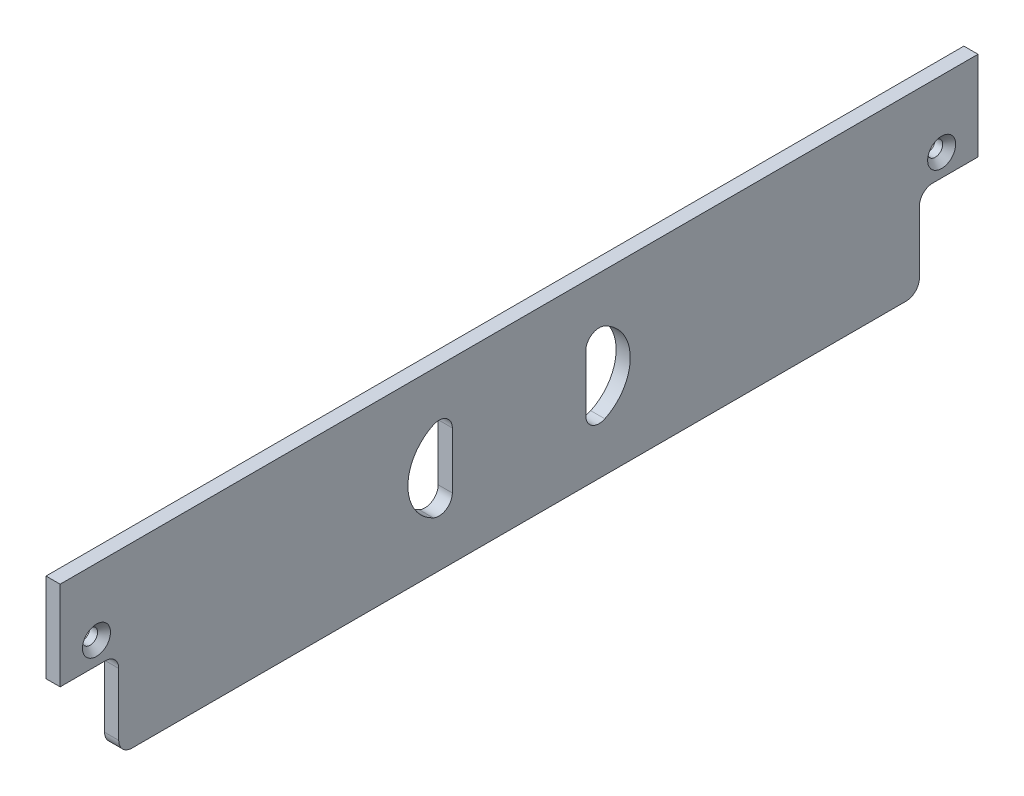
ISO-10303-21;
HEADER;
FILE_DESCRIPTION(('STEP AP214'),'2;1');
FILE_NAME('part.step','',(''),(''),'','','');
FILE_SCHEMA(('AUTOMOTIVE_DESIGN { 1 0 10303 214 1 1 1 1 }'));
ENDSEC;
DATA;
#1=APPLICATION_CONTEXT('core data for automotive mechanical design processes');
#2=APPLICATION_PROTOCOL_DEFINITION('international standard','automotive_design',2000,#1);
#3=PRODUCT_CONTEXT('',#1,'mechanical');
#4=PRODUCT('Part','Part','',(#3));
#5=PRODUCT_RELATED_PRODUCT_CATEGORY('part','',(#4));
#6=PRODUCT_DEFINITION_FORMATION('','',#4);
#7=PRODUCT_DEFINITION_CONTEXT('part definition',#1,'design');
#8=PRODUCT_DEFINITION('design','',#6,#7);
#9=PRODUCT_DEFINITION_SHAPE('','',#8);
#10=(LENGTH_UNIT() NAMED_UNIT(*) SI_UNIT(.MILLI.,.METRE.));
#11=(NAMED_UNIT(*) PLANE_ANGLE_UNIT() SI_UNIT($,.RADIAN.));
#12=(NAMED_UNIT(*) SI_UNIT($,.STERADIAN.) SOLID_ANGLE_UNIT());
#13=UNCERTAINTY_MEASURE_WITH_UNIT(LENGTH_MEASURE(1.E-05),#10,'distance_accuracy_value','');
#14=(GEOMETRIC_REPRESENTATION_CONTEXT(3) GLOBAL_UNCERTAINTY_ASSIGNED_CONTEXT((#13)) GLOBAL_UNIT_ASSIGNED_CONTEXT((#10,
#11,#12)) REPRESENTATION_CONTEXT('',''));
#15=CARTESIAN_POINT('',(0.,0.,0.));
#16=DIRECTION('',(0.,0.,1.));
#17=DIRECTION('',(1.,0.,0.));
#18=AXIS2_PLACEMENT_3D('',#15,#16,#17);
#19=CARTESIAN_POINT('',(3.175,17.,93.));
#20=DIRECTION('',(-1.,0.,0.));
#21=DIRECTION('',(0.,0.,1.));
#22=AXIS2_PLACEMENT_3D('',#19,#20,#21);
#23=PLANE('',#22);
#24=CARTESIAN_POINT('',(3.175,17.,93.));
#25=DIRECTION('',(-1.,0.,0.));
#26=DIRECTION('',(0.,0.,1.));
#27=AXIS2_PLACEMENT_3D('',#24,#25,#26);
#28=CIRCLE('',#27,3.);
#29=CARTESIAN_POINT('',(3.175,20.,93.));
#30=VERTEX_POINT('',#29);
#31=CARTESIAN_POINT('',(3.175,17.,90.));
#32=VERTEX_POINT('',#31);
#33=EDGE_CURVE('E186',#30,#32,#28,.T.);
#34=ORIENTED_EDGE('',*,*,#33,.T.);
#35=DIRECTION('',(0.,-1.,0.));
#36=VECTOR('',#35,1.);
#37=CARTESIAN_POINT('',(3.175,3.,90.));
#38=LINE('',#37,#36);
#39=CARTESIAN_POINT('',(3.175,3.,90.));
#40=VERTEX_POINT('',#39);
#41=EDGE_CURVE('E175',#32,#40,#38,.T.);
#42=ORIENTED_EDGE('',*,*,#41,.T.);
#43=CARTESIAN_POINT('',(3.175,3.,87.));
#44=DIRECTION('',(1.,0.,0.));
#45=DIRECTION('',(0.,0.,1.));
#46=AXIS2_PLACEMENT_3D('',#43,#44,#45);
#47=CIRCLE('',#46,3.);
#48=CARTESIAN_POINT('',(3.175,0.,87.));
#49=VERTEX_POINT('',#48);
#50=EDGE_CURVE('E185',#40,#49,#47,.T.);
#51=ORIENTED_EDGE('',*,*,#50,.T.);
#52=DIRECTION('',(0.,0.,-1.));
#53=VECTOR('',#52,1.);
#54=CARTESIAN_POINT('',(3.175,0.,87.));
#55=LINE('',#54,#53);
#56=CARTESIAN_POINT('',(3.175,0.,-87.));
#57=VERTEX_POINT('',#56);
#58=EDGE_CURVE('E293',#49,#57,#55,.T.);
#59=ORIENTED_EDGE('',*,*,#58,.T.);
#60=CARTESIAN_POINT('',(3.175,3.,-87.));
#61=DIRECTION('',(1.,0.,0.));
#62=DIRECTION('',(0.,0.,-1.));
#63=AXIS2_PLACEMENT_3D('',#60,#61,#62);
#64=CIRCLE('',#63,3.);
#65=CARTESIAN_POINT('',(3.175,3.,-90.));
#66=VERTEX_POINT('',#65);
#67=EDGE_CURVE('E296',#57,#66,#64,.T.);
#68=ORIENTED_EDGE('',*,*,#67,.T.);
#69=DIRECTION('',(0.,1.,0.));
#70=VECTOR('',#69,1.);
#71=CARTESIAN_POINT('',(3.175,3.,-90.));
#72=LINE('',#71,#70);
#73=CARTESIAN_POINT('',(3.175,17.,-90.));
#74=VERTEX_POINT('',#73);
#75=EDGE_CURVE('E298',#66,#74,#72,.T.);
#76=ORIENTED_EDGE('',*,*,#75,.T.);
#77=CARTESIAN_POINT('',(3.175,17.,-93.));
#78=DIRECTION('',(-1.,0.,0.));
#79=DIRECTION('',(0.,0.,-1.));
#80=AXIS2_PLACEMENT_3D('',#77,#78,#79);
#81=CIRCLE('',#80,3.);
#82=CARTESIAN_POINT('',(3.175,20.,-93.));
#83=VERTEX_POINT('',#82);
#84=EDGE_CURVE('E300',#74,#83,#81,.T.);
#85=ORIENTED_EDGE('',*,*,#84,.T.);
#86=DIRECTION('',(0.,0.,-1.));
#87=VECTOR('',#86,1.);
#88=CARTESIAN_POINT('',(3.175,20.,-103.175));
#89=LINE('',#88,#87);
#90=CARTESIAN_POINT('',(3.175,20.,-103.175));
#91=VERTEX_POINT('',#90);
#92=EDGE_CURVE('E302',#83,#91,#89,.T.);
#93=ORIENTED_EDGE('',*,*,#92,.T.);
#94=DIRECTION('',(0.,1.,0.));
#95=VECTOR('',#94,1.);
#96=CARTESIAN_POINT('',(3.175,20.,-103.175));
#97=LINE('',#96,#95);
#98=CARTESIAN_POINT('',(3.175,40.,-103.175));
#99=VERTEX_POINT('',#98);
#100=EDGE_CURVE('E304',#91,#99,#97,.T.);
#101=ORIENTED_EDGE('',*,*,#100,.T.);
#102=DIRECTION('',(0.,0.,1.));
#103=VECTOR('',#102,1.);
#104=CARTESIAN_POINT('',(3.175,40.,103.175));
#105=LINE('',#104,#103);
#106=CARTESIAN_POINT('',(3.175,40.,103.175));
#107=VERTEX_POINT('',#106);
#108=EDGE_CURVE('E306',#99,#107,#105,.T.);
#109=ORIENTED_EDGE('',*,*,#108,.T.);
#110=DIRECTION('',(0.,-1.,0.));
#111=VECTOR('',#110,1.);
#112=CARTESIAN_POINT('',(3.175,20.,103.175));
#113=LINE('',#112,#111);
#114=CARTESIAN_POINT('',(3.175,20.,103.175));
#115=VERTEX_POINT('',#114);
#116=EDGE_CURVE('E308',#107,#115,#113,.T.);
#117=ORIENTED_EDGE('',*,*,#116,.T.);
#118=DIRECTION('',(0.,0.,-1.));
#119=VECTOR('',#118,1.);
#120=CARTESIAN_POINT('',(3.175,20.,103.175));
#121=LINE('',#120,#119);
#122=EDGE_CURVE('E191',#115,#30,#121,.T.);
#123=ORIENTED_EDGE('',*,*,#122,.T.);
#124=EDGE_LOOP('',(#34,#42,#51,#59,#68,#76,#85,#93,#101,#109,#117,#123));
#125=FACE_BOUND('',#124,.T.);
#126=CARTESIAN_POINT('',(3.175,25.,95.));
#127=DIRECTION('',(1.,0.,0.));
#128=DIRECTION('',(0.,0.,-1.));
#129=AXIS2_PLACEMENT_3D('',#126,#127,#128);
#130=CIRCLE('',#129,3.15);
#131=CARTESIAN_POINT('',(3.175,25.,91.85));
#132=VERTEX_POINT('',#131);
#133=EDGE_CURVE('E283',#132,#132,#130,.T.);
#134=ORIENTED_EDGE('',*,*,#133,.F.);
#135=EDGE_LOOP('',(#134));
#136=FACE_BOUND('',#135,.T.);
#137=CARTESIAN_POINT('',(3.175,25.,-95.));
#138=DIRECTION('',(1.,0.,0.));
#139=DIRECTION('',(0.,0.,-1.));
#140=AXIS2_PLACEMENT_3D('',#137,#138,#139);
#141=CIRCLE('',#140,3.15);
#142=CARTESIAN_POINT('',(3.175,25.,-98.15));
#143=VERTEX_POINT('',#142);
#144=EDGE_CURVE('E269',#143,#143,#141,.T.);
#145=ORIENTED_EDGE('',*,*,#144,.F.);
#146=EDGE_LOOP('',(#145));
#147=FACE_BOUND('',#146,.T.);
#148=DIRECTION('',(0.,1.,0.));
#149=VECTOR('',#148,1.);
#150=CARTESIAN_POINT('',(3.175,30.,15.));
#151=LINE('',#150,#149);
#152=CARTESIAN_POINT('',(3.175,13.6754446796632,15.));
#153=VERTEX_POINT('',#152);
#154=CARTESIAN_POINT('',(3.175,26.3245553203368,15.));
#155=VERTEX_POINT('',#154);
#156=EDGE_CURVE('E266',#153,#155,#151,.T.);
#157=ORIENTED_EDGE('',*,*,#156,.F.);
#158=CARTESIAN_POINT('',(3.175,13.6754446796632,18.));
#159=DIRECTION('',(-1.,0.,0.));
#160=DIRECTION('',(0.,0.,1.));
#161=AXIS2_PLACEMENT_3D('',#158,#159,#160);
#162=CIRCLE('',#161,3.);
#163=CARTESIAN_POINT('',(3.175,10.9649209709475,19.2857142857143));
#164=VERTEX_POINT('',#163);
#165=EDGE_CURVE('E220',#153,#164,#162,.T.);
#166=ORIENTED_EDGE('',*,*,#165,.T.);
#167=CARTESIAN_POINT('',(3.175,20.,15.));
#168=DIRECTION('',(1.,0.,0.));
#169=DIRECTION('',(0.,0.,-1.));
#170=AXIS2_PLACEMENT_3D('',#167,#168,#169);
#171=CIRCLE('',#170,10.);
#172=CARTESIAN_POINT('',(3.175,29.0350790290525,19.2857142857143));
#173=VERTEX_POINT('',#172);
#174=EDGE_CURVE('E257',#173,#164,#171,.T.);
#175=ORIENTED_EDGE('',*,*,#174,.F.);
#176=CARTESIAN_POINT('',(3.175,26.3245553203368,18.));
#177=DIRECTION('',(-1.,0.,0.));
#178=DIRECTION('',(0.,0.,1.));
#179=AXIS2_PLACEMENT_3D('',#176,#177,#178);
#180=CIRCLE('',#179,3.);
#181=EDGE_CURVE('E216',#173,#155,#180,.T.);
#182=ORIENTED_EDGE('',*,*,#181,.T.);
#183=EDGE_LOOP('',(#157,#166,#175,#182));
#184=FACE_BOUND('',#183,.T.);
#185=DIRECTION('',(0.,1.,0.));
#186=VECTOR('',#185,1.);
#187=CARTESIAN_POINT('',(3.175,30.,-15.));
#188=LINE('',#187,#186);
#189=CARTESIAN_POINT('',(3.175,13.6754446796632,-15.));
#190=VERTEX_POINT('',#189);
#191=CARTESIAN_POINT('',(3.175,26.3245553203368,-15.));
#192=VERTEX_POINT('',#191);
#193=EDGE_CURVE('E242',#190,#192,#188,.T.);
#194=ORIENTED_EDGE('',*,*,#193,.T.);
#195=CARTESIAN_POINT('',(3.175,26.3245553203368,-18.));
#196=DIRECTION('',(-1.,0.,0.));
#197=DIRECTION('',(0.,0.,1.));
#198=AXIS2_PLACEMENT_3D('',#195,#196,#197);
#199=CIRCLE('',#198,3.);
#200=CARTESIAN_POINT('',(3.175,29.0350790290525,-19.2857142857143));
#201=VERTEX_POINT('',#200);
#202=EDGE_CURVE('E235',#192,#201,#199,.T.);
#203=ORIENTED_EDGE('',*,*,#202,.T.);
#204=CARTESIAN_POINT('',(3.175,20.,-15.));
#205=DIRECTION('',(-1.,0.,0.));
#206=DIRECTION('',(0.,0.,1.));
#207=AXIS2_PLACEMENT_3D('',#204,#205,#206);
#208=CIRCLE('',#207,10.);
#209=CARTESIAN_POINT('',(3.175,10.9649209709475,-19.2857142857143));
#210=VERTEX_POINT('',#209);
#211=EDGE_CURVE('E243',#201,#210,#208,.T.);
#212=ORIENTED_EDGE('',*,*,#211,.T.);
#213=CARTESIAN_POINT('',(3.175,13.6754446796632,-18.));
#214=DIRECTION('',(-1.,0.,0.));
#215=DIRECTION('',(0.,0.,1.));
#216=AXIS2_PLACEMENT_3D('',#213,#214,#215);
#217=CIRCLE('',#216,3.);
#218=EDGE_CURVE('E44',#210,#190,#217,.T.);
#219=ORIENTED_EDGE('',*,*,#218,.T.);
#220=EDGE_LOOP('',(#194,#203,#212,#219));
#221=FACE_BOUND('',#220,.T.);
#222=ADVANCED_FACE('F36',(#125,#136,#147,#184,#221),#23,.F.);
#223=CARTESIAN_POINT('',(0.,17.,93.));
#224=DIRECTION('',(-1.,0.,0.));
#225=DIRECTION('',(0.,0.,1.));
#226=AXIS2_PLACEMENT_3D('',#223,#224,#225);
#227=PLANE('',#226);
#228=CARTESIAN_POINT('',(0.,17.,93.));
#229=DIRECTION('',(-1.,0.,0.));
#230=DIRECTION('',(0.,0.,1.));
#231=AXIS2_PLACEMENT_3D('',#228,#229,#230);
#232=CIRCLE('',#231,3.);
#233=CARTESIAN_POINT('',(0.,20.,93.));
#234=VERTEX_POINT('',#233);
#235=CARTESIAN_POINT('',(0.,17.,90.));
#236=VERTEX_POINT('',#235);
#237=EDGE_CURVE('E199',#234,#236,#232,.T.);
#238=ORIENTED_EDGE('',*,*,#237,.F.);
#239=DIRECTION('',(0.,0.,-1.));
#240=VECTOR('',#239,1.);
#241=CARTESIAN_POINT('',(0.,20.,103.175));
#242=LINE('',#241,#240);
#243=CARTESIAN_POINT('',(0.,20.,103.175));
#244=VERTEX_POINT('',#243);
#245=EDGE_CURVE('E195',#244,#234,#242,.T.);
#246=ORIENTED_EDGE('',*,*,#245,.F.);
#247=DIRECTION('',(0.,-1.,0.));
#248=VECTOR('',#247,1.);
#249=CARTESIAN_POINT('',(0.,20.,103.175));
#250=LINE('',#249,#248);
#251=CARTESIAN_POINT('',(0.,40.,103.175));
#252=VERTEX_POINT('',#251);
#253=EDGE_CURVE('E332',#252,#244,#250,.T.);
#254=ORIENTED_EDGE('',*,*,#253,.F.);
#255=DIRECTION('',(0.,0.,1.));
#256=VECTOR('',#255,1.);
#257=CARTESIAN_POINT('',(0.,40.,103.175));
#258=LINE('',#257,#256);
#259=CARTESIAN_POINT('',(0.,40.,-103.175));
#260=VERTEX_POINT('',#259);
#261=EDGE_CURVE('E330',#260,#252,#258,.T.);
#262=ORIENTED_EDGE('',*,*,#261,.F.);
#263=DIRECTION('',(0.,1.,0.));
#264=VECTOR('',#263,1.);
#265=CARTESIAN_POINT('',(0.,20.,-103.175));
#266=LINE('',#265,#264);
#267=CARTESIAN_POINT('',(0.,20.,-103.175));
#268=VERTEX_POINT('',#267);
#269=EDGE_CURVE('E328',#268,#260,#266,.T.);
#270=ORIENTED_EDGE('',*,*,#269,.F.);
#271=DIRECTION('',(0.,0.,-1.));
#272=VECTOR('',#271,1.);
#273=CARTESIAN_POINT('',(0.,20.,-103.175));
#274=LINE('',#273,#272);
#275=CARTESIAN_POINT('',(0.,20.,-93.));
#276=VERTEX_POINT('',#275);
#277=EDGE_CURVE('E326',#276,#268,#274,.T.);
#278=ORIENTED_EDGE('',*,*,#277,.F.);
#279=CARTESIAN_POINT('',(0.,17.,-93.));
#280=DIRECTION('',(-1.,0.,0.));
#281=DIRECTION('',(0.,0.,-1.));
#282=AXIS2_PLACEMENT_3D('',#279,#280,#281);
#283=CIRCLE('',#282,3.);
#284=CARTESIAN_POINT('',(0.,17.,-90.));
#285=VERTEX_POINT('',#284);
#286=EDGE_CURVE('E324',#285,#276,#283,.T.);
#287=ORIENTED_EDGE('',*,*,#286,.F.);
#288=DIRECTION('',(0.,1.,0.));
#289=VECTOR('',#288,1.);
#290=CARTESIAN_POINT('',(0.,3.,-90.));
#291=LINE('',#290,#289);
#292=CARTESIAN_POINT('',(0.,3.,-90.));
#293=VERTEX_POINT('',#292);
#294=EDGE_CURVE('E322',#293,#285,#291,.T.);
#295=ORIENTED_EDGE('',*,*,#294,.F.);
#296=CARTESIAN_POINT('',(0.,3.,-87.));
#297=DIRECTION('',(1.,0.,0.));
#298=DIRECTION('',(0.,0.,-1.));
#299=AXIS2_PLACEMENT_3D('',#296,#297,#298);
#300=CIRCLE('',#299,3.);
#301=CARTESIAN_POINT('',(0.,0.,-87.));
#302=VERTEX_POINT('',#301);
#303=EDGE_CURVE('E320',#302,#293,#300,.T.);
#304=ORIENTED_EDGE('',*,*,#303,.F.);
#305=DIRECTION('',(0.,0.,-1.));
#306=VECTOR('',#305,1.);
#307=CARTESIAN_POINT('',(0.,0.,87.));
#308=LINE('',#307,#306);
#309=CARTESIAN_POINT('',(0.,0.,87.));
#310=VERTEX_POINT('',#309);
#311=EDGE_CURVE('E317',#310,#302,#308,.T.);
#312=ORIENTED_EDGE('',*,*,#311,.F.);
#313=CARTESIAN_POINT('',(0.,3.,87.));
#314=DIRECTION('',(1.,0.,0.));
#315=DIRECTION('',(0.,0.,1.));
#316=AXIS2_PLACEMENT_3D('',#313,#314,#315);
#317=CIRCLE('',#316,3.);
#318=CARTESIAN_POINT('',(0.,3.,90.));
#319=VERTEX_POINT('',#318);
#320=EDGE_CURVE('E315',#319,#310,#317,.T.);
#321=ORIENTED_EDGE('',*,*,#320,.F.);
#322=DIRECTION('',(0.,-1.,0.));
#323=VECTOR('',#322,1.);
#324=CARTESIAN_POINT('',(0.,3.,90.));
#325=LINE('',#324,#323);
#326=EDGE_CURVE('E313',#236,#319,#325,.T.);
#327=ORIENTED_EDGE('',*,*,#326,.F.);
#328=EDGE_LOOP('',(#238,#246,#254,#262,#270,#278,#287,#295,#304,#312,#321,#327));
#329=FACE_BOUND('',#328,.T.);
#330=CARTESIAN_POINT('',(0.,25.,95.));
#331=DIRECTION('',(1.,0.,0.));
#332=DIRECTION('',(0.,0.,-1.));
#333=AXIS2_PLACEMENT_3D('',#330,#331,#332);
#334=CIRCLE('',#333,1.7);
#335=CARTESIAN_POINT('',(0.,25.,93.3));
#336=VERTEX_POINT('',#335);
#337=EDGE_CURVE('E289',#336,#336,#334,.T.);
#338=ORIENTED_EDGE('',*,*,#337,.T.);
#339=EDGE_LOOP('',(#338));
#340=FACE_BOUND('',#339,.T.);
#341=CARTESIAN_POINT('',(0.,25.,-95.));
#342=DIRECTION('',(1.,0.,0.));
#343=DIRECTION('',(0.,0.,-1.));
#344=AXIS2_PLACEMENT_3D('',#341,#342,#343);
#345=CIRCLE('',#344,1.7);
#346=CARTESIAN_POINT('',(0.,25.,-96.7));
#347=VERTEX_POINT('',#346);
#348=EDGE_CURVE('E280',#347,#347,#345,.T.);
#349=ORIENTED_EDGE('',*,*,#348,.T.);
#350=EDGE_LOOP('',(#349));
#351=FACE_BOUND('',#350,.T.);
#352=DIRECTION('',(0.,1.,0.));
#353=VECTOR('',#352,1.);
#354=CARTESIAN_POINT('',(0.,30.,15.));
#355=LINE('',#354,#353);
#356=CARTESIAN_POINT('',(0.,13.6754446796632,15.));
#357=VERTEX_POINT('',#356);
#358=CARTESIAN_POINT('',(0.,26.3245553203368,15.));
#359=VERTEX_POINT('',#358);
#360=EDGE_CURVE('E265',#357,#359,#355,.T.);
#361=ORIENTED_EDGE('',*,*,#360,.T.);
#362=CARTESIAN_POINT('',(0.,26.3245553203368,18.));
#363=DIRECTION('',(-1.,0.,0.));
#364=DIRECTION('',(0.,0.,1.));
#365=AXIS2_PLACEMENT_3D('',#362,#363,#364);
#366=CIRCLE('',#365,3.);
#367=CARTESIAN_POINT('',(0.,29.0350790290525,19.2857142857143));
#368=VERTEX_POINT('',#367);
#369=EDGE_CURVE('E218',#359,#368,#366,.F.);
#370=ORIENTED_EDGE('',*,*,#369,.T.);
#371=CARTESIAN_POINT('',(0.,20.,15.));
#372=DIRECTION('',(1.,0.,0.));
#373=DIRECTION('',(0.,0.,-1.));
#374=AXIS2_PLACEMENT_3D('',#371,#372,#373);
#375=CIRCLE('',#374,10.);
#376=CARTESIAN_POINT('',(0.,10.9649209709475,19.2857142857143));
#377=VERTEX_POINT('',#376);
#378=EDGE_CURVE('E261',#368,#377,#375,.T.);
#379=ORIENTED_EDGE('',*,*,#378,.T.);
#380=CARTESIAN_POINT('',(0.,13.6754446796632,18.));
#381=DIRECTION('',(-1.,0.,0.));
#382=DIRECTION('',(0.,0.,1.));
#383=AXIS2_PLACEMENT_3D('',#380,#381,#382);
#384=CIRCLE('',#383,3.);
#385=EDGE_CURVE('E223',#377,#357,#384,.F.);
#386=ORIENTED_EDGE('',*,*,#385,.T.);
#387=EDGE_LOOP('',(#361,#370,#379,#386));
#388=FACE_BOUND('',#387,.T.);
#389=DIRECTION('',(0.,1.,0.));
#390=VECTOR('',#389,1.);
#391=CARTESIAN_POINT('',(0.,30.,-15.));
#392=LINE('',#391,#390);
#393=CARTESIAN_POINT('',(0.,13.6754446796632,-15.));
#394=VERTEX_POINT('',#393);
#395=CARTESIAN_POINT('',(0.,26.3245553203368,-15.));
#396=VERTEX_POINT('',#395);
#397=EDGE_CURVE('E255',#394,#396,#392,.T.);
#398=ORIENTED_EDGE('',*,*,#397,.F.);
#399=CARTESIAN_POINT('',(0.,13.6754446796632,-18.));
#400=DIRECTION('',(-1.,0.,0.));
#401=DIRECTION('',(0.,0.,1.));
#402=AXIS2_PLACEMENT_3D('',#399,#400,#401);
#403=CIRCLE('',#402,3.);
#404=CARTESIAN_POINT('',(0.,10.9649209709475,-19.2857142857143));
#405=VERTEX_POINT('',#404);
#406=EDGE_CURVE('E11',#394,#405,#403,.F.);
#407=ORIENTED_EDGE('',*,*,#406,.T.);
#408=CARTESIAN_POINT('',(0.,20.,-15.));
#409=DIRECTION('',(-1.,0.,0.));
#410=DIRECTION('',(0.,0.,1.));
#411=AXIS2_PLACEMENT_3D('',#408,#409,#410);
#412=CIRCLE('',#411,10.);
#413=CARTESIAN_POINT('',(0.,29.0350790290525,-19.2857142857143));
#414=VERTEX_POINT('',#413);
#415=EDGE_CURVE('E251',#414,#405,#412,.T.);
#416=ORIENTED_EDGE('',*,*,#415,.F.);
#417=CARTESIAN_POINT('',(0.,26.3245553203368,-18.));
#418=DIRECTION('',(-1.,0.,0.));
#419=DIRECTION('',(0.,0.,1.));
#420=AXIS2_PLACEMENT_3D('',#417,#418,#419);
#421=CIRCLE('',#420,3.);
#422=EDGE_CURVE('E237',#414,#396,#421,.F.);
#423=ORIENTED_EDGE('',*,*,#422,.T.);
#424=EDGE_LOOP('',(#398,#407,#416,#423));
#425=FACE_BOUND('',#424,.T.);
#426=ADVANCED_FACE('F370',(#329,#340,#351,#388,#425),#227,.T.);
#427=CARTESIAN_POINT('',(3.175,17.,93.));
#428=DIRECTION('',(-1.,0.,0.));
#429=DIRECTION('',(0.,0.,1.));
#430=AXIS2_PLACEMENT_3D('',#427,#428,#429);
#431=CYLINDRICAL_SURFACE('',#430,3.);
#432=ORIENTED_EDGE('',*,*,#237,.T.);
#433=DIRECTION('',(-1.,0.,0.));
#434=VECTOR('',#433,1.);
#435=CARTESIAN_POINT('',(3.175,17.,90.));
#436=LINE('',#435,#434);
#437=EDGE_CURVE('E179',#32,#236,#436,.T.);
#438=ORIENTED_EDGE('',*,*,#437,.F.);
#439=ORIENTED_EDGE('',*,*,#33,.F.);
#440=DIRECTION('',(-1.,0.,0.));
#441=VECTOR('',#440,1.);
#442=CARTESIAN_POINT('',(3.175,20.,93.));
#443=LINE('',#442,#441);
#444=EDGE_CURVE('E311',#30,#234,#443,.T.);
#445=ORIENTED_EDGE('',*,*,#444,.T.);
#446=EDGE_LOOP('',(#432,#438,#439,#445));
#447=FACE_BOUND('',#446,.T.);
#448=ADVANCED_FACE('F197',(#447),#431,.F.);
#449=CARTESIAN_POINT('',(3.175,3.,90.));
#450=DIRECTION('',(0.,0.,-1.));
#451=DIRECTION('',(-1.,0.,0.));
#452=AXIS2_PLACEMENT_3D('',#449,#450,#451);
#453=PLANE('',#452);
#454=ORIENTED_EDGE('',*,*,#326,.T.);
#455=DIRECTION('',(-1.,0.,0.));
#456=VECTOR('',#455,1.);
#457=CARTESIAN_POINT('',(3.175,3.,90.));
#458=LINE('',#457,#456);
#459=EDGE_CURVE('E182',#40,#319,#458,.T.);
#460=ORIENTED_EDGE('',*,*,#459,.F.);
#461=ORIENTED_EDGE('',*,*,#41,.F.);
#462=ORIENTED_EDGE('',*,*,#437,.T.);
#463=EDGE_LOOP('',(#454,#460,#461,#462));
#464=FACE_BOUND('',#463,.T.);
#465=ADVANCED_FACE('F177',(#464),#453,.F.);
#466=CARTESIAN_POINT('',(3.175,3.,87.));
#467=DIRECTION('',(-1.,0.,0.));
#468=DIRECTION('',(0.,0.,1.));
#469=AXIS2_PLACEMENT_3D('',#466,#467,#468);
#470=CYLINDRICAL_SURFACE('',#469,3.);
#471=ORIENTED_EDGE('',*,*,#320,.T.);
#472=DIRECTION('',(-1.,0.,0.));
#473=VECTOR('',#472,1.);
#474=CARTESIAN_POINT('',(3.175,0.,87.));
#475=LINE('',#474,#473);
#476=EDGE_CURVE('E205',#49,#310,#475,.T.);
#477=ORIENTED_EDGE('',*,*,#476,.F.);
#478=ORIENTED_EDGE('',*,*,#50,.F.);
#479=ORIENTED_EDGE('',*,*,#459,.T.);
#480=EDGE_LOOP('',(#471,#477,#478,#479));
#481=FACE_BOUND('',#480,.T.);
#482=ADVANCED_FACE('F384',(#481),#470,.T.);
#483=CARTESIAN_POINT('',(3.175,0.,87.));
#484=DIRECTION('',(0.,1.,0.));
#485=DIRECTION('',(0.,0.,1.));
#486=AXIS2_PLACEMENT_3D('',#483,#484,#485);
#487=PLANE('',#486);
#488=ORIENTED_EDGE('',*,*,#311,.T.);
#489=DIRECTION('',(-1.,0.,0.));
#490=VECTOR('',#489,1.);
#491=CARTESIAN_POINT('',(3.175,0.,-87.));
#492=LINE('',#491,#490);
#493=EDGE_CURVE('E357',#57,#302,#492,.T.);
#494=ORIENTED_EDGE('',*,*,#493,.F.);
#495=ORIENTED_EDGE('',*,*,#58,.F.);
#496=ORIENTED_EDGE('',*,*,#476,.T.);
#497=EDGE_LOOP('',(#488,#494,#495,#496));
#498=FACE_BOUND('',#497,.T.);
#499=ADVANCED_FACE('F364',(#498),#487,.F.);
#500=CARTESIAN_POINT('',(3.175,3.,-87.));
#501=DIRECTION('',(-1.,0.,0.));
#502=DIRECTION('',(0.,0.,1.));
#503=AXIS2_PLACEMENT_3D('',#500,#501,#502);
#504=CYLINDRICAL_SURFACE('',#503,3.);
#505=ORIENTED_EDGE('',*,*,#303,.T.);
#506=DIRECTION('',(-1.,0.,0.));
#507=VECTOR('',#506,1.);
#508=CARTESIAN_POINT('',(3.175,3.,-90.));
#509=LINE('',#508,#507);
#510=EDGE_CURVE('E354',#66,#293,#509,.T.);
#511=ORIENTED_EDGE('',*,*,#510,.F.);
#512=ORIENTED_EDGE('',*,*,#67,.F.);
#513=ORIENTED_EDGE('',*,*,#493,.T.);
#514=EDGE_LOOP('',(#505,#511,#512,#513));
#515=FACE_BOUND('',#514,.T.);
#516=ADVANCED_FACE('F376',(#515),#504,.T.);
#517=CARTESIAN_POINT('',(3.175,3.,-90.));
#518=DIRECTION('',(0.,0.,1.));
#519=DIRECTION('',(1.,0.,0.));
#520=AXIS2_PLACEMENT_3D('',#517,#518,#519);
#521=PLANE('',#520);
#522=ORIENTED_EDGE('',*,*,#294,.T.);
#523=DIRECTION('',(-1.,0.,0.));
#524=VECTOR('',#523,1.);
#525=CARTESIAN_POINT('',(3.175,17.,-90.));
#526=LINE('',#525,#524);
#527=EDGE_CURVE('E351',#74,#285,#526,.T.);
#528=ORIENTED_EDGE('',*,*,#527,.F.);
#529=ORIENTED_EDGE('',*,*,#75,.F.);
#530=ORIENTED_EDGE('',*,*,#510,.T.);
#531=EDGE_LOOP('',(#522,#528,#529,#530));
#532=FACE_BOUND('',#531,.T.);
#533=ADVANCED_FACE('F380',(#532),#521,.F.);
#534=CARTESIAN_POINT('',(3.175,17.,-93.));
#535=DIRECTION('',(-1.,0.,0.));
#536=DIRECTION('',(0.,0.,1.));
#537=AXIS2_PLACEMENT_3D('',#534,#535,#536);
#538=CYLINDRICAL_SURFACE('',#537,3.);
#539=ORIENTED_EDGE('',*,*,#286,.T.);
#540=DIRECTION('',(-1.,0.,0.));
#541=VECTOR('',#540,1.);
#542=CARTESIAN_POINT('',(3.175,20.,-93.));
#543=LINE('',#542,#541);
#544=EDGE_CURVE('E348',#83,#276,#543,.T.);
#545=ORIENTED_EDGE('',*,*,#544,.F.);
#546=ORIENTED_EDGE('',*,*,#84,.F.);
#547=ORIENTED_EDGE('',*,*,#527,.T.);
#548=EDGE_LOOP('',(#539,#545,#546,#547));
#549=FACE_BOUND('',#548,.T.);
#550=ADVANCED_FACE('F422',(#549),#538,.F.);
#551=CARTESIAN_POINT('',(3.175,20.,-103.175));
#552=DIRECTION('',(0.,1.,0.));
#553=DIRECTION('',(0.,0.,1.));
#554=AXIS2_PLACEMENT_3D('',#551,#552,#553);
#555=PLANE('',#554);
#556=ORIENTED_EDGE('',*,*,#277,.T.);
#557=DIRECTION('',(-1.,0.,0.));
#558=VECTOR('',#557,1.);
#559=CARTESIAN_POINT('',(3.175,20.,-103.175));
#560=LINE('',#559,#558);
#561=EDGE_CURVE('E345',#91,#268,#560,.T.);
#562=ORIENTED_EDGE('',*,*,#561,.F.);
#563=ORIENTED_EDGE('',*,*,#92,.F.);
#564=ORIENTED_EDGE('',*,*,#544,.T.);
#565=EDGE_LOOP('',(#556,#562,#563,#564));
#566=FACE_BOUND('',#565,.T.);
#567=ADVANCED_FACE('F418',(#566),#555,.F.);
#568=CARTESIAN_POINT('',(3.175,20.,-103.175));
#569=DIRECTION('',(0.,0.,1.));
#570=DIRECTION('',(1.,0.,0.));
#571=AXIS2_PLACEMENT_3D('',#568,#569,#570);
#572=PLANE('',#571);
#573=ORIENTED_EDGE('',*,*,#269,.T.);
#574=DIRECTION('',(-1.,0.,0.));
#575=VECTOR('',#574,1.);
#576=CARTESIAN_POINT('',(3.175,40.,-103.175));
#577=LINE('',#576,#575);
#578=EDGE_CURVE('E342',#99,#260,#577,.T.);
#579=ORIENTED_EDGE('',*,*,#578,.F.);
#580=ORIENTED_EDGE('',*,*,#100,.F.);
#581=ORIENTED_EDGE('',*,*,#561,.T.);
#582=EDGE_LOOP('',(#573,#579,#580,#581));
#583=FACE_BOUND('',#582,.T.);
#584=ADVANCED_FACE('F414',(#583),#572,.F.);
#585=CARTESIAN_POINT('',(3.175,40.,103.175));
#586=DIRECTION('',(0.,-1.,0.));
#587=DIRECTION('',(0.,0.,-1.));
#588=AXIS2_PLACEMENT_3D('',#585,#586,#587);
#589=PLANE('',#588);
#590=ORIENTED_EDGE('',*,*,#261,.T.);
#591=DIRECTION('',(-1.,0.,0.));
#592=VECTOR('',#591,1.);
#593=CARTESIAN_POINT('',(3.175,40.,103.175));
#594=LINE('',#593,#592);
#595=EDGE_CURVE('E339',#107,#252,#594,.T.);
#596=ORIENTED_EDGE('',*,*,#595,.F.);
#597=ORIENTED_EDGE('',*,*,#108,.F.);
#598=ORIENTED_EDGE('',*,*,#578,.T.);
#599=EDGE_LOOP('',(#590,#596,#597,#598));
#600=FACE_BOUND('',#599,.T.);
#601=ADVANCED_FACE('F410',(#600),#589,.F.);
#602=CARTESIAN_POINT('',(3.175,20.,103.175));
#603=DIRECTION('',(0.,0.,-1.));
#604=DIRECTION('',(-1.,0.,0.));
#605=AXIS2_PLACEMENT_3D('',#602,#603,#604);
#606=PLANE('',#605);
#607=ORIENTED_EDGE('',*,*,#253,.T.);
#608=DIRECTION('',(-1.,0.,0.));
#609=VECTOR('',#608,1.);
#610=CARTESIAN_POINT('',(3.175,20.,103.175));
#611=LINE('',#610,#609);
#612=EDGE_CURVE('E336',#115,#244,#611,.T.);
#613=ORIENTED_EDGE('',*,*,#612,.F.);
#614=ORIENTED_EDGE('',*,*,#116,.F.);
#615=ORIENTED_EDGE('',*,*,#595,.T.);
#616=EDGE_LOOP('',(#607,#613,#614,#615));
#617=FACE_BOUND('',#616,.T.);
#618=ADVANCED_FACE('F406',(#617),#606,.F.);
#619=CARTESIAN_POINT('',(3.175,20.,103.175));
#620=DIRECTION('',(0.,1.,0.));
#621=DIRECTION('',(0.,0.,1.));
#622=AXIS2_PLACEMENT_3D('',#619,#620,#621);
#623=PLANE('',#622);
#624=ORIENTED_EDGE('',*,*,#245,.T.);
#625=ORIENTED_EDGE('',*,*,#444,.F.);
#626=ORIENTED_EDGE('',*,*,#122,.F.);
#627=ORIENTED_EDGE('',*,*,#612,.T.);
#628=EDGE_LOOP('',(#624,#625,#626,#627));
#629=FACE_BOUND('',#628,.T.);
#630=ADVANCED_FACE('F403',(#629),#623,.F.);
#631=CARTESIAN_POINT('',(3.175,25.,95.));
#632=DIRECTION('',(1.,0.,0.));
#633=DIRECTION('',(0.,0.,-1.));
#634=AXIS2_PLACEMENT_3D('',#631,#632,#633);
#635=CYLINDRICAL_SURFACE('',#634,1.69999999999999);
#636=ORIENTED_EDGE('',*,*,#337,.F.);
#637=EDGE_LOOP('',(#636));
#638=FACE_BOUND('',#637,.T.);
#639=CARTESIAN_POINT('',(1.72499999999999,25.,95.));
#640=DIRECTION('',(1.,0.,0.));
#641=DIRECTION('',(0.,0.,-1.));
#642=AXIS2_PLACEMENT_3D('',#639,#640,#641);
#643=CIRCLE('',#642,1.69999999999999);
#644=CARTESIAN_POINT('',(1.72499999999999,25.,93.3));
#645=VERTEX_POINT('',#644);
#646=EDGE_CURVE('E286',#645,#645,#643,.T.);
#647=ORIENTED_EDGE('',*,*,#646,.T.);
#648=EDGE_LOOP('',(#647));
#649=FACE_BOUND('',#648,.T.);
#650=ADVANCED_FACE('F400',(#638,#649),#635,.F.);
#651=CARTESIAN_POINT('',(3.175,25.,95.));
#652=DIRECTION('',(1.,0.,0.));
#653=DIRECTION('',(0.,0.,-1.));
#654=AXIS2_PLACEMENT_3D('',#651,#652,#653);
#655=CONICAL_SURFACE('',#654,3.15,0.78539816339745);
#656=ORIENTED_EDGE('',*,*,#646,.F.);
#657=EDGE_LOOP('',(#656));
#658=FACE_BOUND('',#657,.T.);
#659=ORIENTED_EDGE('',*,*,#133,.T.);
#660=EDGE_LOOP('',(#659));
#661=FACE_BOUND('',#660,.T.);
#662=ADVANCED_FACE('F468',(#658,#661),#655,.F.);
#663=CARTESIAN_POINT('',(3.175,25.,-95.));
#664=DIRECTION('',(1.,0.,0.));
#665=DIRECTION('',(0.,0.,-1.));
#666=AXIS2_PLACEMENT_3D('',#663,#664,#665);
#667=CYLINDRICAL_SURFACE('',#666,1.69999999999999);
#668=ORIENTED_EDGE('',*,*,#348,.F.);
#669=EDGE_LOOP('',(#668));
#670=FACE_BOUND('',#669,.T.);
#671=CARTESIAN_POINT('',(1.72499999999999,25.,-95.));
#672=DIRECTION('',(1.,0.,0.));
#673=DIRECTION('',(0.,0.,-1.));
#674=AXIS2_PLACEMENT_3D('',#671,#672,#673);
#675=CIRCLE('',#674,1.69999999999999);
#676=CARTESIAN_POINT('',(1.72499999999999,25.,-96.7));
#677=VERTEX_POINT('',#676);
#678=EDGE_CURVE('E277',#677,#677,#675,.T.);
#679=ORIENTED_EDGE('',*,*,#678,.T.);
#680=EDGE_LOOP('',(#679));
#681=FACE_BOUND('',#680,.T.);
#682=ADVANCED_FACE('F475',(#670,#681),#667,.F.);
#683=CARTESIAN_POINT('',(3.175,25.,-95.));
#684=DIRECTION('',(1.,0.,0.));
#685=DIRECTION('',(0.,0.,-1.));
#686=AXIS2_PLACEMENT_3D('',#683,#684,#685);
#687=CONICAL_SURFACE('',#686,3.15,0.78539816339745);
#688=ORIENTED_EDGE('',*,*,#678,.F.);
#689=EDGE_LOOP('',(#688));
#690=FACE_BOUND('',#689,.T.);
#691=ORIENTED_EDGE('',*,*,#144,.T.);
#692=EDGE_LOOP('',(#691));
#693=FACE_BOUND('',#692,.T.);
#694=ADVANCED_FACE('F482',(#690,#693),#687,.F.);
#695=CARTESIAN_POINT('',(0.,20.,15.));
#696=DIRECTION('',(1.,0.,0.));
#697=DIRECTION('',(0.,0.,-1.));
#698=AXIS2_PLACEMENT_3D('',#695,#696,#697);
#699=CYLINDRICAL_SURFACE('',#698,10.);
#700=ORIENTED_EDGE('',*,*,#378,.F.);
#701=DIRECTION('',(1.,0.,0.));
#702=VECTOR('',#701,1.);
#703=CARTESIAN_POINT('',(0.,29.0350790290525,19.2857142857143));
#704=LINE('',#703,#702);
#705=EDGE_CURVE('E203',#368,#173,#704,.T.);
#706=ORIENTED_EDGE('',*,*,#705,.T.);
#707=ORIENTED_EDGE('',*,*,#174,.T.);
#708=DIRECTION('',(1.,0.,0.));
#709=VECTOR('',#708,1.);
#710=CARTESIAN_POINT('',(0.,10.9649209709475,19.2857142857143));
#711=LINE('',#710,#709);
#712=EDGE_CURVE('E200',#164,#377,#711,.F.);
#713=ORIENTED_EDGE('',*,*,#712,.T.);
#714=EDGE_LOOP('',(#700,#706,#707,#713));
#715=FACE_BOUND('',#714,.T.);
#716=ADVANCED_FACE('F490',(#715),#699,.F.);
#717=CARTESIAN_POINT('',(0.,30.,15.));
#718=DIRECTION('',(0.,0.,-1.));
#719=DIRECTION('',(-1.,0.,0.));
#720=AXIS2_PLACEMENT_3D('',#717,#718,#719);
#721=PLANE('',#720);
#722=ORIENTED_EDGE('',*,*,#156,.T.);
#723=DIRECTION('',(-1.,0.,0.));
#724=VECTOR('',#723,1.);
#725=CARTESIAN_POINT('',(0.,26.3245553203368,15.));
#726=LINE('',#725,#724);
#727=EDGE_CURVE('E214',#155,#359,#726,.T.);
#728=ORIENTED_EDGE('',*,*,#727,.T.);
#729=ORIENTED_EDGE('',*,*,#360,.F.);
#730=DIRECTION('',(-1.,0.,0.));
#731=VECTOR('',#730,1.);
#732=CARTESIAN_POINT('',(3.175,13.6754446796632,15.));
#733=LINE('',#732,#731);
#734=EDGE_CURVE('E211',#357,#153,#733,.F.);
#735=ORIENTED_EDGE('',*,*,#734,.T.);
#736=EDGE_LOOP('',(#722,#728,#729,#735));
#737=FACE_BOUND('',#736,.T.);
#738=ADVANCED_FACE('F498',(#737),#721,.F.);
#739=CARTESIAN_POINT('',(0.,26.3245553203368,18.));
#740=DIRECTION('',(1.,0.,0.));
#741=DIRECTION('',(0.,0.,-1.));
#742=AXIS2_PLACEMENT_3D('',#739,#740,#741);
#743=CYLINDRICAL_SURFACE('',#742,3.);
#744=ORIENTED_EDGE('',*,*,#369,.F.);
#745=ORIENTED_EDGE('',*,*,#727,.F.);
#746=ORIENTED_EDGE('',*,*,#181,.F.);
#747=ORIENTED_EDGE('',*,*,#705,.F.);
#748=EDGE_LOOP('',(#744,#745,#746,#747));
#749=FACE_BOUND('',#748,.T.);
#750=ADVANCED_FACE('F506',(#749),#743,.F.);
#751=CARTESIAN_POINT('',(0.,13.6754446796632,18.));
#752=DIRECTION('',(1.,0.,0.));
#753=DIRECTION('',(0.,0.,-1.));
#754=AXIS2_PLACEMENT_3D('',#751,#752,#753);
#755=CYLINDRICAL_SURFACE('',#754,3.);
#756=ORIENTED_EDGE('',*,*,#385,.F.);
#757=ORIENTED_EDGE('',*,*,#712,.F.);
#758=ORIENTED_EDGE('',*,*,#165,.F.);
#759=ORIENTED_EDGE('',*,*,#734,.F.);
#760=EDGE_LOOP('',(#756,#757,#758,#759));
#761=FACE_BOUND('',#760,.T.);
#762=ADVANCED_FACE('F514',(#761),#755,.F.);
#763=CARTESIAN_POINT('',(0.,20.,-15.));
#764=DIRECTION('',(1.,0.,0.));
#765=DIRECTION('',(0.,0.,-1.));
#766=AXIS2_PLACEMENT_3D('',#763,#764,#765);
#767=CYLINDRICAL_SURFACE('',#766,10.);
#768=ORIENTED_EDGE('',*,*,#211,.F.);
#769=DIRECTION('',(1.,0.,0.));
#770=VECTOR('',#769,1.);
#771=CARTESIAN_POINT('',(0.,29.0350790290525,-19.2857142857143));
#772=LINE('',#771,#770);
#773=EDGE_CURVE('E56',#201,#414,#772,.F.);
#774=ORIENTED_EDGE('',*,*,#773,.T.);
#775=ORIENTED_EDGE('',*,*,#415,.T.);
#776=DIRECTION('',(1.,0.,0.));
#777=VECTOR('',#776,1.);
#778=CARTESIAN_POINT('',(0.,10.9649209709475,-19.2857142857143));
#779=LINE('',#778,#777);
#780=EDGE_CURVE('E231',#405,#210,#779,.T.);
#781=ORIENTED_EDGE('',*,*,#780,.T.);
#782=EDGE_LOOP('',(#768,#774,#775,#781));
#783=FACE_BOUND('',#782,.T.);
#784=ADVANCED_FACE('F253',(#783),#767,.F.);
#785=CARTESIAN_POINT('',(0.,30.,-15.));
#786=DIRECTION('',(0.,0.,-1.));
#787=DIRECTION('',(-1.,0.,0.));
#788=AXIS2_PLACEMENT_3D('',#785,#786,#787);
#789=PLANE('',#788);
#790=ORIENTED_EDGE('',*,*,#397,.T.);
#791=DIRECTION('',(-1.,0.,0.));
#792=VECTOR('',#791,1.);
#793=CARTESIAN_POINT('',(3.175,26.3245553203368,-15.));
#794=LINE('',#793,#792);
#795=EDGE_CURVE('E228',#396,#192,#794,.F.);
#796=ORIENTED_EDGE('',*,*,#795,.T.);
#797=ORIENTED_EDGE('',*,*,#193,.F.);
#798=DIRECTION('',(-1.,0.,0.));
#799=VECTOR('',#798,1.);
#800=CARTESIAN_POINT('',(0.,13.6754446796632,-15.));
#801=LINE('',#800,#799);
#802=EDGE_CURVE('E226',#190,#394,#801,.T.);
#803=ORIENTED_EDGE('',*,*,#802,.T.);
#804=EDGE_LOOP('',(#790,#796,#797,#803));
#805=FACE_BOUND('',#804,.T.);
#806=ADVANCED_FACE('F249',(#805),#789,.T.);
#807=CARTESIAN_POINT('',(0.,26.3245553203368,-18.));
#808=DIRECTION('',(1.,0.,0.));
#809=DIRECTION('',(0.,0.,-1.));
#810=AXIS2_PLACEMENT_3D('',#807,#808,#809);
#811=CYLINDRICAL_SURFACE('',#810,3.);
#812=ORIENTED_EDGE('',*,*,#422,.F.);
#813=ORIENTED_EDGE('',*,*,#773,.F.);
#814=ORIENTED_EDGE('',*,*,#202,.F.);
#815=ORIENTED_EDGE('',*,*,#795,.F.);
#816=EDGE_LOOP('',(#812,#813,#814,#815));
#817=FACE_BOUND('',#816,.T.);
#818=ADVANCED_FACE('F536',(#817),#811,.F.);
#819=CARTESIAN_POINT('',(0.,13.6754446796632,-18.));
#820=DIRECTION('',(1.,0.,0.));
#821=DIRECTION('',(0.,0.,-1.));
#822=AXIS2_PLACEMENT_3D('',#819,#820,#821);
#823=CYLINDRICAL_SURFACE('',#822,3.);
#824=ORIENTED_EDGE('',*,*,#406,.F.);
#825=ORIENTED_EDGE('',*,*,#802,.F.);
#826=ORIENTED_EDGE('',*,*,#218,.F.);
#827=ORIENTED_EDGE('',*,*,#780,.F.);
#828=EDGE_LOOP('',(#824,#825,#826,#827));
#829=FACE_BOUND('',#828,.T.);
#830=ADVANCED_FACE('F38',(#829),#823,.F.);
#831=CLOSED_SHELL('',(#222,#426,#448,#465,#482,#499,#516,#533,#550,#567,#584,#601,#618,#630,
#650,#662,#682,#694,#716,#738,#750,#762,#784,#806,#818,#830));
#832=MANIFOLD_SOLID_BREP('B2',#831);
#833=ADVANCED_BREP_SHAPE_REPRESENTATION('',(#18,#832),#14);
#834=SHAPE_DEFINITION_REPRESENTATION(#9,#833);
ENDSEC;
END-ISO-10303-21;
